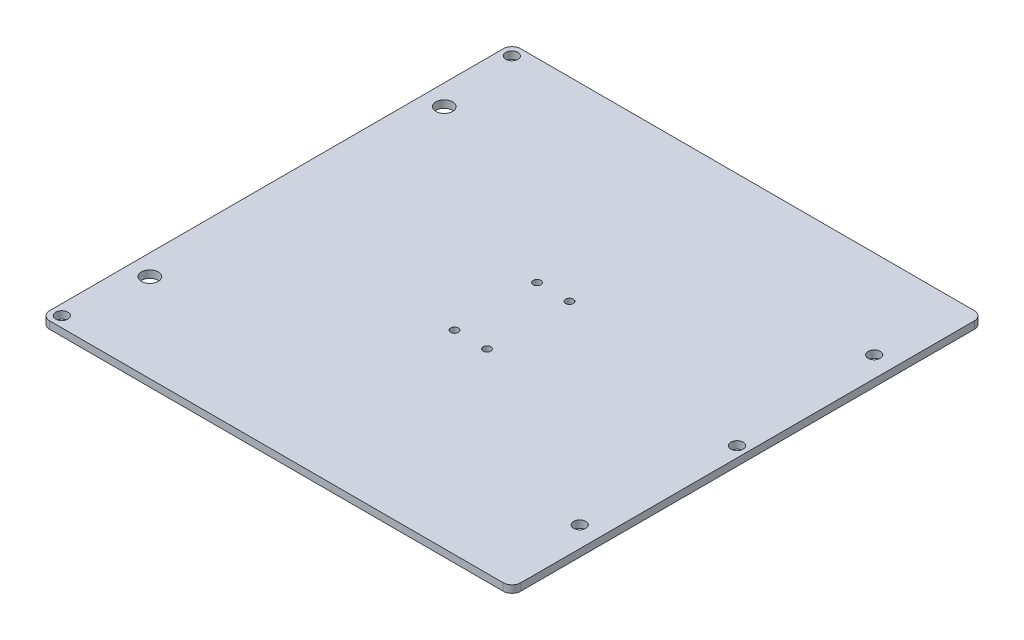
ISO-10303-21;
HEADER;
FILE_DESCRIPTION(('STEP AP214'),'2;1');
FILE_NAME('part.step','',(''),(''),'','','');
FILE_SCHEMA(('AUTOMOTIVE_DESIGN { 1 0 10303 214 1 1 1 1 }'));
ENDSEC;
DATA;
#1=APPLICATION_CONTEXT('core data for automotive mechanical design processes');
#2=APPLICATION_PROTOCOL_DEFINITION('international standard','automotive_design',2000,#1);
#3=PRODUCT_CONTEXT('',#1,'mechanical');
#4=PRODUCT('Part','Part','',(#3));
#5=PRODUCT_RELATED_PRODUCT_CATEGORY('part','',(#4));
#6=PRODUCT_DEFINITION_FORMATION('','',#4);
#7=PRODUCT_DEFINITION_CONTEXT('part definition',#1,'design');
#8=PRODUCT_DEFINITION('design','',#6,#7);
#9=PRODUCT_DEFINITION_SHAPE('','',#8);
#10=(LENGTH_UNIT() NAMED_UNIT(*) SI_UNIT(.MILLI.,.METRE.));
#11=(NAMED_UNIT(*) PLANE_ANGLE_UNIT() SI_UNIT($,.RADIAN.));
#12=(NAMED_UNIT(*) SI_UNIT($,.STERADIAN.) SOLID_ANGLE_UNIT());
#13=UNCERTAINTY_MEASURE_WITH_UNIT(LENGTH_MEASURE(1.E-05),#10,'distance_accuracy_value','');
#14=(GEOMETRIC_REPRESENTATION_CONTEXT(3) GLOBAL_UNCERTAINTY_ASSIGNED_CONTEXT((#13)) GLOBAL_UNIT_ASSIGNED_CONTEXT((#10,
#11,#12)) REPRESENTATION_CONTEXT('',''));
#15=CARTESIAN_POINT('',(0.,0.,0.));
#16=DIRECTION('',(0.,0.,1.));
#17=DIRECTION('',(1.,0.,0.));
#18=AXIS2_PLACEMENT_3D('',#15,#16,#17);
#19=CARTESIAN_POINT('',(0.,3.175,0.));
#20=DIRECTION('',(1.,0.,0.));
#21=DIRECTION('',(0.,0.,-1.));
#22=AXIS2_PLACEMENT_3D('',#19,#20,#21);
#23=PLANE('',#22);
#24=DIRECTION('',(0.,0.,1.));
#25=VECTOR('',#24,1.);
#26=CARTESIAN_POINT('',(0.,3.175,0.));
#27=LINE('',#26,#25);
#28=CARTESIAN_POINT('',(0.,3.175,-199.39));
#29=VERTEX_POINT('',#28);
#30=CARTESIAN_POINT('',(0.,3.175,-3.81));
#31=VERTEX_POINT('',#30);
#32=EDGE_CURVE('E118',#29,#31,#27,.T.);
#33=ORIENTED_EDGE('',*,*,#32,.F.);
#34=DIRECTION('',(0.,-1.,0.));
#35=VECTOR('',#34,1.);
#36=CARTESIAN_POINT('',(0.,3.175,-199.39));
#37=LINE('',#36,#35);
#38=CARTESIAN_POINT('',(0.,0.,-199.39));
#39=VERTEX_POINT('',#38);
#40=EDGE_CURVE('E103',#29,#39,#37,.T.);
#41=ORIENTED_EDGE('',*,*,#40,.T.);
#42=DIRECTION('',(0.,0.,1.));
#43=VECTOR('',#42,1.);
#44=CARTESIAN_POINT('',(0.,0.,0.));
#45=LINE('',#44,#43);
#46=CARTESIAN_POINT('',(0.,0.,-3.81));
#47=VERTEX_POINT('',#46);
#48=EDGE_CURVE('E115',#39,#47,#45,.T.);
#49=ORIENTED_EDGE('',*,*,#48,.T.);
#50=DIRECTION('',(0.,-1.,0.));
#51=VECTOR('',#50,1.);
#52=CARTESIAN_POINT('',(0.,3.175,-3.81));
#53=LINE('',#52,#51);
#54=EDGE_CURVE('E120',#47,#31,#53,.F.);
#55=ORIENTED_EDGE('',*,*,#54,.T.);
#56=EDGE_LOOP('',(#33,#41,#49,#55));
#57=FACE_BOUND('',#56,.T.);
#58=ADVANCED_FACE('F33',(#57),#23,.F.);
#59=CARTESIAN_POINT('',(0.,3.175,0.));
#60=DIRECTION('',(0.,0.,-1.));
#61=DIRECTION('',(-1.,0.,0.));
#62=AXIS2_PLACEMENT_3D('',#59,#60,#61);
#63=PLANE('',#62);
#64=DIRECTION('',(1.,0.,0.));
#65=VECTOR('',#64,1.);
#66=CARTESIAN_POINT('',(0.,0.,0.));
#67=LINE('',#66,#65);
#68=CARTESIAN_POINT('',(3.81,0.,0.));
#69=VERTEX_POINT('',#68);
#70=CARTESIAN_POINT('',(199.39,0.,0.));
#71=VERTEX_POINT('',#70);
#72=EDGE_CURVE('E124',#69,#71,#67,.T.);
#73=ORIENTED_EDGE('',*,*,#72,.T.);
#74=DIRECTION('',(0.,-1.,0.));
#75=VECTOR('',#74,1.);
#76=CARTESIAN_POINT('',(199.39,3.175,0.));
#77=LINE('',#76,#75);
#78=CARTESIAN_POINT('',(199.39,3.175,0.));
#79=VERTEX_POINT('',#78);
#80=EDGE_CURVE('E11',#71,#79,#77,.F.);
#81=ORIENTED_EDGE('',*,*,#80,.T.);
#82=DIRECTION('',(1.,0.,0.));
#83=VECTOR('',#82,1.);
#84=CARTESIAN_POINT('',(0.,3.175,0.));
#85=LINE('',#84,#83);
#86=CARTESIAN_POINT('',(3.81,3.175,0.));
#87=VERTEX_POINT('',#86);
#88=EDGE_CURVE('E164',#87,#79,#85,.T.);
#89=ORIENTED_EDGE('',*,*,#88,.F.);
#90=DIRECTION('',(0.,-1.,0.));
#91=VECTOR('',#90,1.);
#92=CARTESIAN_POINT('',(3.81,3.175,0.));
#93=LINE('',#92,#91);
#94=EDGE_CURVE('E41',#87,#69,#93,.T.);
#95=ORIENTED_EDGE('',*,*,#94,.T.);
#96=EDGE_LOOP('',(#73,#81,#89,#95));
#97=FACE_BOUND('',#96,.T.);
#98=ADVANCED_FACE('F162',(#97),#63,.F.);
#99=CARTESIAN_POINT('',(203.2,3.175,0.));
#100=DIRECTION('',(-1.,0.,0.));
#101=DIRECTION('',(0.,0.,1.));
#102=AXIS2_PLACEMENT_3D('',#99,#100,#101);
#103=PLANE('',#102);
#104=DIRECTION('',(0.,0.,-1.));
#105=VECTOR('',#104,1.);
#106=CARTESIAN_POINT('',(203.2,0.,0.));
#107=LINE('',#106,#105);
#108=CARTESIAN_POINT('',(203.2,0.,-3.81));
#109=VERTEX_POINT('',#108);
#110=CARTESIAN_POINT('',(203.2,0.,-199.39));
#111=VERTEX_POINT('',#110);
#112=EDGE_CURVE('E128',#109,#111,#107,.T.);
#113=ORIENTED_EDGE('',*,*,#112,.T.);
#114=DIRECTION('',(0.,-1.,0.));
#115=VECTOR('',#114,1.);
#116=CARTESIAN_POINT('',(203.2,3.175,-199.39));
#117=LINE('',#116,#115);
#118=CARTESIAN_POINT('',(203.2,3.175,-199.39));
#119=VERTEX_POINT('',#118);
#120=EDGE_CURVE('E48',#111,#119,#117,.F.);
#121=ORIENTED_EDGE('',*,*,#120,.T.);
#122=DIRECTION('',(0.,0.,-1.));
#123=VECTOR('',#122,1.);
#124=CARTESIAN_POINT('',(203.2,3.175,0.));
#125=LINE('',#124,#123);
#126=CARTESIAN_POINT('',(203.2,3.175,-3.81));
#127=VERTEX_POINT('',#126);
#128=EDGE_CURVE('E172',#127,#119,#125,.T.);
#129=ORIENTED_EDGE('',*,*,#128,.F.);
#130=DIRECTION('',(0.,-1.,0.));
#131=VECTOR('',#130,1.);
#132=CARTESIAN_POINT('',(203.2,3.175,-3.81));
#133=LINE('',#132,#131);
#134=EDGE_CURVE('E155',#127,#109,#133,.T.);
#135=ORIENTED_EDGE('',*,*,#134,.T.);
#136=EDGE_LOOP('',(#113,#121,#129,#135));
#137=FACE_BOUND('',#136,.T.);
#138=ADVANCED_FACE('F171',(#137),#103,.F.);
#139=CARTESIAN_POINT('',(0.,3.175,-203.2));
#140=DIRECTION('',(0.,0.,1.));
#141=DIRECTION('',(1.,0.,0.));
#142=AXIS2_PLACEMENT_3D('',#139,#140,#141);
#143=PLANE('',#142);
#144=DIRECTION('',(-1.,0.,0.));
#145=VECTOR('',#144,1.);
#146=CARTESIAN_POINT('',(0.,0.,-203.2));
#147=LINE('',#146,#145);
#148=CARTESIAN_POINT('',(199.39,0.,-203.2));
#149=VERTEX_POINT('',#148);
#150=CARTESIAN_POINT('',(3.81,0.,-203.2));
#151=VERTEX_POINT('',#150);
#152=EDGE_CURVE('E138',#149,#151,#147,.T.);
#153=ORIENTED_EDGE('',*,*,#152,.T.);
#154=DIRECTION('',(0.,-1.,0.));
#155=VECTOR('',#154,1.);
#156=CARTESIAN_POINT('',(3.81,3.175,-203.2));
#157=LINE('',#156,#155);
#158=CARTESIAN_POINT('',(3.81,3.175,-203.2));
#159=VERTEX_POINT('',#158);
#160=EDGE_CURVE('E104',#151,#159,#157,.F.);
#161=ORIENTED_EDGE('',*,*,#160,.T.);
#162=DIRECTION('',(-1.,0.,0.));
#163=VECTOR('',#162,1.);
#164=CARTESIAN_POINT('',(0.,3.175,-203.2));
#165=LINE('',#164,#163);
#166=CARTESIAN_POINT('',(199.39,3.175,-203.2));
#167=VERTEX_POINT('',#166);
#168=EDGE_CURVE('E134',#167,#159,#165,.T.);
#169=ORIENTED_EDGE('',*,*,#168,.F.);
#170=DIRECTION('',(0.,-1.,0.));
#171=VECTOR('',#170,1.);
#172=CARTESIAN_POINT('',(199.39,3.175,-203.2));
#173=LINE('',#172,#171);
#174=EDGE_CURVE('E109',#167,#149,#173,.T.);
#175=ORIENTED_EDGE('',*,*,#174,.T.);
#176=EDGE_LOOP('',(#153,#161,#169,#175));
#177=FACE_BOUND('',#176,.T.);
#178=ADVANCED_FACE('F246',(#177),#143,.F.);
#179=CARTESIAN_POINT('',(0.,3.175,0.));
#180=DIRECTION('',(0.,-1.,0.));
#181=DIRECTION('',(0.,0.,-1.));
#182=AXIS2_PLACEMENT_3D('',#179,#180,#181);
#183=PLANE('',#182);
#184=CARTESIAN_POINT('',(94.6,3.175,-83.82));
#185=DIRECTION('',(0.,1.,0.));
#186=DIRECTION('',(0.,0.,-1.));
#187=AXIS2_PLACEMENT_3D('',#184,#185,#186);
#188=CIRCLE('',#187,1.65);
#189=CARTESIAN_POINT('',(94.6,3.175,-85.47));
#190=VERTEX_POINT('',#189);
#191=EDGE_CURVE('E232',#190,#190,#188,.T.);
#192=ORIENTED_EDGE('',*,*,#191,.F.);
#193=EDGE_LOOP('',(#192));
#194=FACE_BOUND('',#193,.T.);
#195=CARTESIAN_POINT('',(108.6,3.175,-83.82));
#196=DIRECTION('',(0.,1.,0.));
#197=DIRECTION('',(0.,0.,-1.));
#198=AXIS2_PLACEMENT_3D('',#195,#196,#197);
#199=CIRCLE('',#198,1.65);
#200=CARTESIAN_POINT('',(108.6,3.175,-85.47));
#201=VERTEX_POINT('',#200);
#202=EDGE_CURVE('E226',#201,#201,#199,.T.);
#203=ORIENTED_EDGE('',*,*,#202,.F.);
#204=EDGE_LOOP('',(#203));
#205=FACE_BOUND('',#204,.T.);
#206=CARTESIAN_POINT('',(108.6,3.175,-119.38));
#207=DIRECTION('',(0.,1.,0.));
#208=DIRECTION('',(0.,0.,1.));
#209=AXIS2_PLACEMENT_3D('',#206,#207,#208);
#210=CIRCLE('',#209,1.65);
#211=CARTESIAN_POINT('',(108.6,3.175,-117.73));
#212=VERTEX_POINT('',#211);
#213=EDGE_CURVE('E220',#212,#212,#210,.T.);
#214=ORIENTED_EDGE('',*,*,#213,.F.);
#215=EDGE_LOOP('',(#214));
#216=FACE_BOUND('',#215,.T.);
#217=CARTESIAN_POINT('',(94.6,3.175,-119.38));
#218=DIRECTION('',(0.,1.,0.));
#219=DIRECTION('',(0.,0.,1.));
#220=AXIS2_PLACEMENT_3D('',#217,#218,#219);
#221=CIRCLE('',#220,1.65);
#222=CARTESIAN_POINT('',(94.6,3.175,-117.73));
#223=VERTEX_POINT('',#222);
#224=EDGE_CURVE('E216',#223,#223,#221,.T.);
#225=ORIENTED_EDGE('',*,*,#224,.F.);
#226=EDGE_LOOP('',(#225));
#227=FACE_BOUND('',#226,.T.);
#228=CARTESIAN_POINT('',(198.628,3.175,-101.6));
#229=DIRECTION('',(0.,-1.,0.));
#230=DIRECTION('',(0.,0.,-1.));
#231=AXIS2_PLACEMENT_3D('',#228,#229,#230);
#232=CIRCLE('',#231,2.625);
#233=CARTESIAN_POINT('',(198.628,3.175,-104.225));
#234=VERTEX_POINT('',#233);
#235=EDGE_CURVE('E210',#234,#234,#232,.F.);
#236=ORIENTED_EDGE('',*,*,#235,.F.);
#237=EDGE_LOOP('',(#236));
#238=FACE_BOUND('',#237,.T.);
#239=CARTESIAN_POINT('',(4.50088000000001,3.175,-198.628));
#240=DIRECTION('',(0.,-1.,0.));
#241=DIRECTION('',(0.,0.,-1.));
#242=AXIS2_PLACEMENT_3D('',#239,#240,#241);
#243=CIRCLE('',#242,2.625);
#244=CARTESIAN_POINT('',(4.50088000000001,3.175,-201.253));
#245=VERTEX_POINT('',#244);
#246=EDGE_CURVE('E204',#245,#245,#243,.F.);
#247=ORIENTED_EDGE('',*,*,#246,.F.);
#248=EDGE_LOOP('',(#247));
#249=FACE_BOUND('',#248,.T.);
#250=CARTESIAN_POINT('',(4.50088,3.175,-4.572));
#251=DIRECTION('',(0.,-1.,0.));
#252=DIRECTION('',(0.,0.,-1.));
#253=AXIS2_PLACEMENT_3D('',#250,#251,#252);
#254=CIRCLE('',#253,2.625);
#255=CARTESIAN_POINT('',(4.50088,3.175,-7.197));
#256=VERTEX_POINT('',#255);
#257=EDGE_CURVE('E196',#256,#256,#254,.F.);
#258=ORIENTED_EDGE('',*,*,#257,.F.);
#259=EDGE_LOOP('',(#258));
#260=FACE_BOUND('',#259,.T.);
#261=CARTESIAN_POINT('',(194.29857,3.175,-165.1));
#262=DIRECTION('',(0.,1.,0.));
#263=DIRECTION('',(0.,0.,-1.));
#264=AXIS2_PLACEMENT_3D('',#261,#262,#263);
#265=CIRCLE('',#264,2.625);
#266=CARTESIAN_POINT('',(194.29857,3.175,-167.725));
#267=VERTEX_POINT('',#266);
#268=EDGE_CURVE('E190',#267,#267,#265,.T.);
#269=ORIENTED_EDGE('',*,*,#268,.F.);
#270=EDGE_LOOP('',(#269));
#271=FACE_BOUND('',#270,.T.);
#272=CARTESIAN_POINT('',(194.29857,3.175,-38.1));
#273=DIRECTION('',(0.,1.,0.));
#274=DIRECTION('',(0.,0.,-1.));
#275=AXIS2_PLACEMENT_3D('',#272,#273,#274);
#276=CIRCLE('',#275,2.625);
#277=CARTESIAN_POINT('',(194.29857,3.175,-40.725));
#278=VERTEX_POINT('',#277);
#279=EDGE_CURVE('E184',#278,#278,#276,.T.);
#280=ORIENTED_EDGE('',*,*,#279,.F.);
#281=EDGE_LOOP('',(#280));
#282=FACE_BOUND('',#281,.T.);
#283=CARTESIAN_POINT('',(8.90142999999996,3.175,-165.1));
#284=DIRECTION('',(0.,1.,0.));
#285=DIRECTION('',(0.,0.,1.));
#286=AXIS2_PLACEMENT_3D('',#283,#284,#285);
#287=CIRCLE('',#286,3.59999999999999);
#288=CARTESIAN_POINT('',(8.90142999999996,3.175,-161.5));
#289=VERTEX_POINT('',#288);
#290=EDGE_CURVE('E179',#289,#289,#287,.T.);
#291=ORIENTED_EDGE('',*,*,#290,.F.);
#292=EDGE_LOOP('',(#291));
#293=FACE_BOUND('',#292,.T.);
#294=CARTESIAN_POINT('',(8.90143,3.175,-38.1));
#295=DIRECTION('',(0.,1.,0.));
#296=DIRECTION('',(0.,0.,1.));
#297=AXIS2_PLACEMENT_3D('',#294,#295,#296);
#298=CIRCLE('',#297,3.6);
#299=CARTESIAN_POINT('',(8.90143,3.175,-34.5));
#300=VERTEX_POINT('',#299);
#301=EDGE_CURVE('E125',#300,#300,#298,.T.);
#302=ORIENTED_EDGE('',*,*,#301,.F.);
#303=EDGE_LOOP('',(#302));
#304=FACE_BOUND('',#303,.T.);
#305=ORIENTED_EDGE('',*,*,#168,.T.);
#306=CARTESIAN_POINT('',(3.81,3.175,-199.39));
#307=DIRECTION('',(0.,-1.,0.));
#308=DIRECTION('',(0.,0.,-1.));
#309=AXIS2_PLACEMENT_3D('',#306,#307,#308);
#310=CIRCLE('',#309,3.81);
#311=EDGE_CURVE('E153',#159,#29,#310,.F.);
#312=ORIENTED_EDGE('',*,*,#311,.T.);
#313=ORIENTED_EDGE('',*,*,#32,.T.);
#314=CARTESIAN_POINT('',(3.81,3.175,-3.81));
#315=DIRECTION('',(0.,-1.,0.));
#316=DIRECTION('',(0.,0.,-1.));
#317=AXIS2_PLACEMENT_3D('',#314,#315,#316);
#318=CIRCLE('',#317,3.81);
#319=EDGE_CURVE('E148',#31,#87,#318,.F.);
#320=ORIENTED_EDGE('',*,*,#319,.T.);
#321=ORIENTED_EDGE('',*,*,#88,.T.);
#322=CARTESIAN_POINT('',(199.39,3.175,-3.81));
#323=DIRECTION('',(0.,-1.,0.));
#324=DIRECTION('',(0.,0.,-1.));
#325=AXIS2_PLACEMENT_3D('',#322,#323,#324);
#326=CIRCLE('',#325,3.81);
#327=EDGE_CURVE('E55',#79,#127,#326,.F.);
#328=ORIENTED_EDGE('',*,*,#327,.T.);
#329=ORIENTED_EDGE('',*,*,#128,.T.);
#330=CARTESIAN_POINT('',(199.39,3.175,-199.39));
#331=DIRECTION('',(0.,-1.,0.));
#332=DIRECTION('',(0.,0.,-1.));
#333=AXIS2_PLACEMENT_3D('',#330,#331,#332);
#334=CIRCLE('',#333,3.81);
#335=EDGE_CURVE('E151',#119,#167,#334,.F.);
#336=ORIENTED_EDGE('',*,*,#335,.T.);
#337=EDGE_LOOP('',(#305,#312,#313,#320,#321,#328,#329,#336));
#338=FACE_BOUND('',#337,.T.);
#339=ADVANCED_FACE('F243',(#194,#205,#216,#227,#238,#249,#260,#271,#282,#293,#304,#338),#183,.F.);
#340=CARTESIAN_POINT('',(0.,0.,0.));
#341=DIRECTION('',(0.,-1.,0.));
#342=DIRECTION('',(0.,0.,-1.));
#343=AXIS2_PLACEMENT_3D('',#340,#341,#342);
#344=PLANE('',#343);
#345=CARTESIAN_POINT('',(94.6,0.,-83.82));
#346=DIRECTION('',(0.,-1.,0.));
#347=DIRECTION('',(0.,0.,-1.));
#348=AXIS2_PLACEMENT_3D('',#345,#346,#347);
#349=CIRCLE('',#348,1.65);
#350=CARTESIAN_POINT('',(94.6,0.,-85.47));
#351=VERTEX_POINT('',#350);
#352=EDGE_CURVE('E235',#351,#351,#349,.F.);
#353=ORIENTED_EDGE('',*,*,#352,.T.);
#354=EDGE_LOOP('',(#353));
#355=FACE_BOUND('',#354,.T.);
#356=CARTESIAN_POINT('',(108.6,0.,-83.82));
#357=DIRECTION('',(0.,-1.,0.));
#358=DIRECTION('',(0.,0.,-1.));
#359=AXIS2_PLACEMENT_3D('',#356,#357,#358);
#360=CIRCLE('',#359,1.65);
#361=CARTESIAN_POINT('',(108.6,0.,-85.47));
#362=VERTEX_POINT('',#361);
#363=EDGE_CURVE('E229',#362,#362,#360,.F.);
#364=ORIENTED_EDGE('',*,*,#363,.T.);
#365=EDGE_LOOP('',(#364));
#366=FACE_BOUND('',#365,.T.);
#367=CARTESIAN_POINT('',(108.6,0.,-119.38));
#368=DIRECTION('',(0.,-1.,0.));
#369=DIRECTION('',(0.,0.,-1.));
#370=AXIS2_PLACEMENT_3D('',#367,#368,#369);
#371=CIRCLE('',#370,1.65);
#372=CARTESIAN_POINT('',(108.6,0.,-121.03));
#373=VERTEX_POINT('',#372);
#374=EDGE_CURVE('E223',#373,#373,#371,.F.);
#375=ORIENTED_EDGE('',*,*,#374,.T.);
#376=EDGE_LOOP('',(#375));
#377=FACE_BOUND('',#376,.T.);
#378=CARTESIAN_POINT('',(94.6,0.,-119.38));
#379=DIRECTION('',(0.,-1.,0.));
#380=DIRECTION('',(0.,0.,-1.));
#381=AXIS2_PLACEMENT_3D('',#378,#379,#380);
#382=CIRCLE('',#381,1.65);
#383=CARTESIAN_POINT('',(94.6,0.,-121.03));
#384=VERTEX_POINT('',#383);
#385=EDGE_CURVE('E217',#384,#384,#382,.F.);
#386=ORIENTED_EDGE('',*,*,#385,.T.);
#387=EDGE_LOOP('',(#386));
#388=FACE_BOUND('',#387,.T.);
#389=CARTESIAN_POINT('',(198.628,0.,-101.6));
#390=DIRECTION('',(0.,-1.,0.));
#391=DIRECTION('',(0.,0.,-1.));
#392=AXIS2_PLACEMENT_3D('',#389,#390,#391);
#393=CIRCLE('',#392,2.625);
#394=CARTESIAN_POINT('',(198.628,0.,-104.225));
#395=VERTEX_POINT('',#394);
#396=EDGE_CURVE('E213',#395,#395,#393,.T.);
#397=ORIENTED_EDGE('',*,*,#396,.F.);
#398=EDGE_LOOP('',(#397));
#399=FACE_BOUND('',#398,.T.);
#400=CARTESIAN_POINT('',(4.50088000000001,0.,-198.628));
#401=DIRECTION('',(0.,-1.,0.));
#402=DIRECTION('',(0.,0.,-1.));
#403=AXIS2_PLACEMENT_3D('',#400,#401,#402);
#404=CIRCLE('',#403,2.625);
#405=CARTESIAN_POINT('',(4.50088000000001,0.,-201.253));
#406=VERTEX_POINT('',#405);
#407=EDGE_CURVE('E207',#406,#406,#404,.T.);
#408=ORIENTED_EDGE('',*,*,#407,.F.);
#409=EDGE_LOOP('',(#408));
#410=FACE_BOUND('',#409,.T.);
#411=CARTESIAN_POINT('',(4.50088,0.,-4.572));
#412=DIRECTION('',(0.,-1.,0.));
#413=DIRECTION('',(0.,0.,-1.));
#414=AXIS2_PLACEMENT_3D('',#411,#412,#413);
#415=CIRCLE('',#414,2.625);
#416=CARTESIAN_POINT('',(4.50088,0.,-7.197));
#417=VERTEX_POINT('',#416);
#418=EDGE_CURVE('E201',#417,#417,#415,.T.);
#419=ORIENTED_EDGE('',*,*,#418,.F.);
#420=EDGE_LOOP('',(#419));
#421=FACE_BOUND('',#420,.T.);
#422=CARTESIAN_POINT('',(194.29857,0.,-165.1));
#423=DIRECTION('',(0.,-1.,0.));
#424=DIRECTION('',(0.,0.,-1.));
#425=AXIS2_PLACEMENT_3D('',#422,#423,#424);
#426=CIRCLE('',#425,2.625);
#427=CARTESIAN_POINT('',(194.29857,0.,-167.725));
#428=VERTEX_POINT('',#427);
#429=EDGE_CURVE('E193',#428,#428,#426,.F.);
#430=ORIENTED_EDGE('',*,*,#429,.T.);
#431=EDGE_LOOP('',(#430));
#432=FACE_BOUND('',#431,.T.);
#433=CARTESIAN_POINT('',(194.29857,0.,-38.1));
#434=DIRECTION('',(0.,-1.,0.));
#435=DIRECTION('',(0.,0.,-1.));
#436=AXIS2_PLACEMENT_3D('',#433,#434,#435);
#437=CIRCLE('',#436,2.625);
#438=CARTESIAN_POINT('',(194.29857,0.,-40.725));
#439=VERTEX_POINT('',#438);
#440=EDGE_CURVE('E187',#439,#439,#437,.F.);
#441=ORIENTED_EDGE('',*,*,#440,.T.);
#442=EDGE_LOOP('',(#441));
#443=FACE_BOUND('',#442,.T.);
#444=CARTESIAN_POINT('',(8.90142999999996,0.,-165.1));
#445=DIRECTION('',(0.,-1.,0.));
#446=DIRECTION('',(0.,0.,-1.));
#447=AXIS2_PLACEMENT_3D('',#444,#445,#446);
#448=CIRCLE('',#447,3.59999999999999);
#449=CARTESIAN_POINT('',(8.90142999999996,0.,-168.7));
#450=VERTEX_POINT('',#449);
#451=EDGE_CURVE('E181',#450,#450,#448,.F.);
#452=ORIENTED_EDGE('',*,*,#451,.T.);
#453=EDGE_LOOP('',(#452));
#454=FACE_BOUND('',#453,.T.);
#455=CARTESIAN_POINT('',(8.90143,0.,-38.1));
#456=DIRECTION('',(0.,-1.,0.));
#457=DIRECTION('',(0.,0.,-1.));
#458=AXIS2_PLACEMENT_3D('',#455,#456,#457);
#459=CIRCLE('',#458,3.6);
#460=CARTESIAN_POINT('',(8.90143,0.,-41.7));
#461=VERTEX_POINT('',#460);
#462=EDGE_CURVE('E131',#461,#461,#459,.F.);
#463=ORIENTED_EDGE('',*,*,#462,.T.);
#464=EDGE_LOOP('',(#463));
#465=FACE_BOUND('',#464,.T.);
#466=ORIENTED_EDGE('',*,*,#48,.F.);
#467=CARTESIAN_POINT('',(3.81,0.,-199.39));
#468=DIRECTION('',(0.,-1.,0.));
#469=DIRECTION('',(0.,0.,-1.));
#470=AXIS2_PLACEMENT_3D('',#467,#468,#469);
#471=CIRCLE('',#470,3.81);
#472=EDGE_CURVE('E99',#39,#151,#471,.T.);
#473=ORIENTED_EDGE('',*,*,#472,.T.);
#474=ORIENTED_EDGE('',*,*,#152,.F.);
#475=CARTESIAN_POINT('',(199.39,0.,-199.39));
#476=DIRECTION('',(0.,-1.,0.));
#477=DIRECTION('',(0.,0.,-1.));
#478=AXIS2_PLACEMENT_3D('',#475,#476,#477);
#479=CIRCLE('',#478,3.81);
#480=EDGE_CURVE('E110',#149,#111,#479,.T.);
#481=ORIENTED_EDGE('',*,*,#480,.T.);
#482=ORIENTED_EDGE('',*,*,#112,.F.);
#483=CARTESIAN_POINT('',(199.39,0.,-3.81));
#484=DIRECTION('',(0.,-1.,0.));
#485=DIRECTION('',(0.,0.,-1.));
#486=AXIS2_PLACEMENT_3D('',#483,#484,#485);
#487=CIRCLE('',#486,3.81);
#488=EDGE_CURVE('E142',#109,#71,#487,.T.);
#489=ORIENTED_EDGE('',*,*,#488,.T.);
#490=ORIENTED_EDGE('',*,*,#72,.F.);
#491=CARTESIAN_POINT('',(3.81,0.,-3.81));
#492=DIRECTION('',(0.,-1.,0.));
#493=DIRECTION('',(0.,0.,-1.));
#494=AXIS2_PLACEMENT_3D('',#491,#492,#493);
#495=CIRCLE('',#494,3.81);
#496=EDGE_CURVE('E119',#69,#47,#495,.T.);
#497=ORIENTED_EDGE('',*,*,#496,.T.);
#498=EDGE_LOOP('',(#466,#473,#474,#481,#482,#489,#490,#497));
#499=FACE_BOUND('',#498,.T.);
#500=ADVANCED_FACE('F122',(#355,#366,#377,#388,#399,#410,#421,#432,#443,#454,#465,#499),#344,.T.);
#501=CARTESIAN_POINT('',(8.90143,-0.00100000000000013,-38.1));
#502=DIRECTION('',(0.,1.,0.));
#503=DIRECTION('',(0.,0.,1.));
#504=AXIS2_PLACEMENT_3D('',#501,#502,#503);
#505=CYLINDRICAL_SURFACE('',#504,3.6);
#506=ORIENTED_EDGE('',*,*,#462,.F.);
#507=EDGE_LOOP('',(#506));
#508=FACE_BOUND('',#507,.T.);
#509=ORIENTED_EDGE('',*,*,#301,.T.);
#510=EDGE_LOOP('',(#509));
#511=FACE_BOUND('',#510,.T.);
#512=ADVANCED_FACE('F292',(#508,#511),#505,.F.);
#513=CARTESIAN_POINT('',(8.90142999999996,-0.00100000000000013,-165.1));
#514=DIRECTION('',(0.,1.,0.));
#515=DIRECTION('',(0.,0.,1.));
#516=AXIS2_PLACEMENT_3D('',#513,#514,#515);
#517=CYLINDRICAL_SURFACE('',#516,3.59999999999999);
#518=ORIENTED_EDGE('',*,*,#451,.F.);
#519=EDGE_LOOP('',(#518));
#520=FACE_BOUND('',#519,.T.);
#521=ORIENTED_EDGE('',*,*,#290,.T.);
#522=EDGE_LOOP('',(#521));
#523=FACE_BOUND('',#522,.T.);
#524=ADVANCED_FACE('F297',(#520,#523),#517,.F.);
#525=CARTESIAN_POINT('',(194.29857,-0.00100000000000013,-38.1));
#526=DIRECTION('',(0.,1.,0.));
#527=DIRECTION('',(0.,0.,1.));
#528=AXIS2_PLACEMENT_3D('',#525,#526,#527);
#529=CYLINDRICAL_SURFACE('',#528,2.625);
#530=ORIENTED_EDGE('',*,*,#440,.F.);
#531=EDGE_LOOP('',(#530));
#532=FACE_BOUND('',#531,.T.);
#533=ORIENTED_EDGE('',*,*,#279,.T.);
#534=EDGE_LOOP('',(#533));
#535=FACE_BOUND('',#534,.T.);
#536=ADVANCED_FACE('F301',(#532,#535),#529,.F.);
#537=CARTESIAN_POINT('',(194.29857,-0.00100000000000013,-165.1));
#538=DIRECTION('',(0.,1.,0.));
#539=DIRECTION('',(0.,0.,1.));
#540=AXIS2_PLACEMENT_3D('',#537,#538,#539);
#541=CYLINDRICAL_SURFACE('',#540,2.625);
#542=ORIENTED_EDGE('',*,*,#429,.F.);
#543=EDGE_LOOP('',(#542));
#544=FACE_BOUND('',#543,.T.);
#545=ORIENTED_EDGE('',*,*,#268,.T.);
#546=EDGE_LOOP('',(#545));
#547=FACE_BOUND('',#546,.T.);
#548=ADVANCED_FACE('F305',(#544,#547),#541,.F.);
#549=CARTESIAN_POINT('',(4.50088,3.176,-4.572));
#550=DIRECTION('',(0.,-1.,0.));
#551=DIRECTION('',(0.,0.,-1.));
#552=AXIS2_PLACEMENT_3D('',#549,#550,#551);
#553=CYLINDRICAL_SURFACE('',#552,2.625);
#554=ORIENTED_EDGE('',*,*,#418,.T.);
#555=EDGE_LOOP('',(#554));
#556=FACE_BOUND('',#555,.T.);
#557=ORIENTED_EDGE('',*,*,#257,.T.);
#558=EDGE_LOOP('',(#557));
#559=FACE_BOUND('',#558,.T.);
#560=ADVANCED_FACE('F309',(#556,#559),#553,.F.);
#561=CARTESIAN_POINT('',(4.50088000000001,3.176,-198.628));
#562=DIRECTION('',(0.,-1.,0.));
#563=DIRECTION('',(0.,0.,-1.));
#564=AXIS2_PLACEMENT_3D('',#561,#562,#563);
#565=CYLINDRICAL_SURFACE('',#564,2.625);
#566=ORIENTED_EDGE('',*,*,#407,.T.);
#567=EDGE_LOOP('',(#566));
#568=FACE_BOUND('',#567,.T.);
#569=ORIENTED_EDGE('',*,*,#246,.T.);
#570=EDGE_LOOP('',(#569));
#571=FACE_BOUND('',#570,.T.);
#572=ADVANCED_FACE('F313',(#568,#571),#565,.F.);
#573=CARTESIAN_POINT('',(198.628,3.176,-101.6));
#574=DIRECTION('',(0.,-1.,0.));
#575=DIRECTION('',(0.,0.,-1.));
#576=AXIS2_PLACEMENT_3D('',#573,#574,#575);
#577=CYLINDRICAL_SURFACE('',#576,2.625);
#578=ORIENTED_EDGE('',*,*,#396,.T.);
#579=EDGE_LOOP('',(#578));
#580=FACE_BOUND('',#579,.T.);
#581=ORIENTED_EDGE('',*,*,#235,.T.);
#582=EDGE_LOOP('',(#581));
#583=FACE_BOUND('',#582,.T.);
#584=ADVANCED_FACE('F278',(#580,#583),#577,.F.);
#585=CARTESIAN_POINT('',(3.81,3.175,-199.39));
#586=DIRECTION('',(0.,-1.,0.));
#587=DIRECTION('',(0.,0.,-1.));
#588=AXIS2_PLACEMENT_3D('',#585,#586,#587);
#589=CYLINDRICAL_SURFACE('',#588,3.81);
#590=ORIENTED_EDGE('',*,*,#311,.F.);
#591=ORIENTED_EDGE('',*,*,#160,.F.);
#592=ORIENTED_EDGE('',*,*,#472,.F.);
#593=ORIENTED_EDGE('',*,*,#40,.F.);
#594=EDGE_LOOP('',(#590,#591,#592,#593));
#595=FACE_BOUND('',#594,.T.);
#596=ADVANCED_FACE('F102',(#595),#589,.T.);
#597=CARTESIAN_POINT('',(199.39,3.175,-199.39));
#598=DIRECTION('',(0.,-1.,0.));
#599=DIRECTION('',(0.,0.,-1.));
#600=AXIS2_PLACEMENT_3D('',#597,#598,#599);
#601=CYLINDRICAL_SURFACE('',#600,3.81);
#602=ORIENTED_EDGE('',*,*,#335,.F.);
#603=ORIENTED_EDGE('',*,*,#120,.F.);
#604=ORIENTED_EDGE('',*,*,#480,.F.);
#605=ORIENTED_EDGE('',*,*,#174,.F.);
#606=EDGE_LOOP('',(#602,#603,#604,#605));
#607=FACE_BOUND('',#606,.T.);
#608=ADVANCED_FACE('F271',(#607),#601,.T.);
#609=CARTESIAN_POINT('',(199.39,3.175,-3.81));
#610=DIRECTION('',(0.,-1.,0.));
#611=DIRECTION('',(0.,0.,-1.));
#612=AXIS2_PLACEMENT_3D('',#609,#610,#611);
#613=CYLINDRICAL_SURFACE('',#612,3.81);
#614=ORIENTED_EDGE('',*,*,#327,.F.);
#615=ORIENTED_EDGE('',*,*,#80,.F.);
#616=ORIENTED_EDGE('',*,*,#488,.F.);
#617=ORIENTED_EDGE('',*,*,#134,.F.);
#618=EDGE_LOOP('',(#614,#615,#616,#617));
#619=FACE_BOUND('',#618,.T.);
#620=ADVANCED_FACE('F170',(#619),#613,.T.);
#621=CARTESIAN_POINT('',(3.81,3.175,-3.81));
#622=DIRECTION('',(0.,-1.,0.));
#623=DIRECTION('',(0.,0.,-1.));
#624=AXIS2_PLACEMENT_3D('',#621,#622,#623);
#625=CYLINDRICAL_SURFACE('',#624,3.81);
#626=ORIENTED_EDGE('',*,*,#319,.F.);
#627=ORIENTED_EDGE('',*,*,#54,.F.);
#628=ORIENTED_EDGE('',*,*,#496,.F.);
#629=ORIENTED_EDGE('',*,*,#94,.F.);
#630=EDGE_LOOP('',(#626,#627,#628,#629));
#631=FACE_BOUND('',#630,.T.);
#632=ADVANCED_FACE('F35',(#631),#625,.T.);
#633=CARTESIAN_POINT('',(94.6,-0.00100000000000013,-119.38));
#634=DIRECTION('',(0.,1.,0.));
#635=DIRECTION('',(0.,0.,1.));
#636=AXIS2_PLACEMENT_3D('',#633,#634,#635);
#637=CYLINDRICAL_SURFACE('',#636,1.65);
#638=ORIENTED_EDGE('',*,*,#385,.F.);
#639=EDGE_LOOP('',(#638));
#640=FACE_BOUND('',#639,.T.);
#641=ORIENTED_EDGE('',*,*,#224,.T.);
#642=EDGE_LOOP('',(#641));
#643=FACE_BOUND('',#642,.T.);
#644=ADVANCED_FACE('F321',(#640,#643),#637,.F.);
#645=CARTESIAN_POINT('',(108.6,-0.00100000000000013,-119.38));
#646=DIRECTION('',(0.,1.,0.));
#647=DIRECTION('',(0.,0.,1.));
#648=AXIS2_PLACEMENT_3D('',#645,#646,#647);
#649=CYLINDRICAL_SURFACE('',#648,1.65);
#650=ORIENTED_EDGE('',*,*,#374,.F.);
#651=EDGE_LOOP('',(#650));
#652=FACE_BOUND('',#651,.T.);
#653=ORIENTED_EDGE('',*,*,#213,.T.);
#654=EDGE_LOOP('',(#653));
#655=FACE_BOUND('',#654,.T.);
#656=ADVANCED_FACE('F324',(#652,#655),#649,.F.);
#657=CARTESIAN_POINT('',(108.6,-0.00100000000000013,-83.82));
#658=DIRECTION('',(0.,1.,0.));
#659=DIRECTION('',(0.,0.,1.));
#660=AXIS2_PLACEMENT_3D('',#657,#658,#659);
#661=CYLINDRICAL_SURFACE('',#660,1.65);
#662=ORIENTED_EDGE('',*,*,#363,.F.);
#663=EDGE_LOOP('',(#662));
#664=FACE_BOUND('',#663,.T.);
#665=ORIENTED_EDGE('',*,*,#202,.T.);
#666=EDGE_LOOP('',(#665));
#667=FACE_BOUND('',#666,.T.);
#668=ADVANCED_FACE('F328',(#664,#667),#661,.F.);
#669=CARTESIAN_POINT('',(94.6,-0.00100000000000013,-83.82));
#670=DIRECTION('',(0.,1.,0.));
#671=DIRECTION('',(0.,0.,1.));
#672=AXIS2_PLACEMENT_3D('',#669,#670,#671);
#673=CYLINDRICAL_SURFACE('',#672,1.65);
#674=ORIENTED_EDGE('',*,*,#352,.F.);
#675=EDGE_LOOP('',(#674));
#676=FACE_BOUND('',#675,.T.);
#677=ORIENTED_EDGE('',*,*,#191,.T.);
#678=EDGE_LOOP('',(#677));
#679=FACE_BOUND('',#678,.T.);
#680=ADVANCED_FACE('F241',(#676,#679),#673,.F.);
#681=CLOSED_SHELL('',(#58,#98,#138,#178,#339,#500,#512,#524,#536,#548,#560,#572,#584,#596,#608,
#620,#632,#644,#656,#668,#680));
#682=MANIFOLD_SOLID_BREP('B2',#681);
#683=ADVANCED_BREP_SHAPE_REPRESENTATION('',(#18,#682),#14);
#684=SHAPE_DEFINITION_REPRESENTATION(#9,#683);
ENDSEC;
END-ISO-10303-21;
